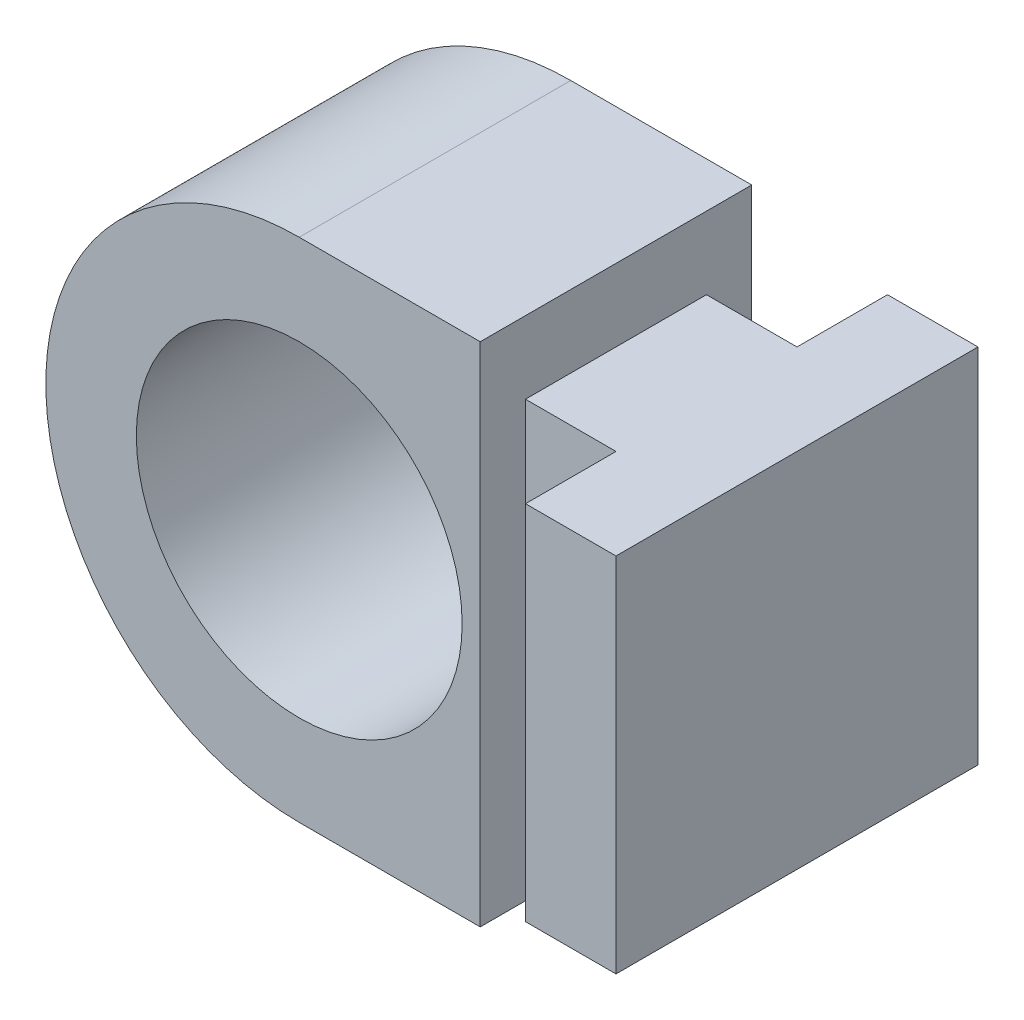
ISO-10303-21;
HEADER;
FILE_DESCRIPTION(('STEP AP214'),'2;1');
FILE_NAME('part.step','',(''),(''),'','','');
FILE_SCHEMA(('AUTOMOTIVE_DESIGN { 1 0 10303 214 1 1 1 1 }'));
ENDSEC;
DATA;
#1=APPLICATION_CONTEXT('core data for automotive mechanical design processes');
#2=APPLICATION_PROTOCOL_DEFINITION('international standard','automotive_design',2000,#1);
#3=PRODUCT_CONTEXT('',#1,'mechanical');
#4=PRODUCT('Part','Part','',(#3));
#5=PRODUCT_RELATED_PRODUCT_CATEGORY('part','',(#4));
#6=PRODUCT_DEFINITION_FORMATION('','',#4);
#7=PRODUCT_DEFINITION_CONTEXT('part definition',#1,'design');
#8=PRODUCT_DEFINITION('design','',#6,#7);
#9=PRODUCT_DEFINITION_SHAPE('','',#8);
#10=(LENGTH_UNIT() NAMED_UNIT(*) SI_UNIT(.MILLI.,.METRE.));
#11=(NAMED_UNIT(*) PLANE_ANGLE_UNIT() SI_UNIT($,.RADIAN.));
#12=(NAMED_UNIT(*) SI_UNIT($,.STERADIAN.) SOLID_ANGLE_UNIT());
#13=UNCERTAINTY_MEASURE_WITH_UNIT(LENGTH_MEASURE(1.E-05),#10,'distance_accuracy_value','');
#14=(GEOMETRIC_REPRESENTATION_CONTEXT(3) GLOBAL_UNCERTAINTY_ASSIGNED_CONTEXT((#13)) GLOBAL_UNIT_ASSIGNED_CONTEXT((#10,
#11,#12)) REPRESENTATION_CONTEXT('',''));
#15=CARTESIAN_POINT('',(0.,0.,0.));
#16=DIRECTION('',(0.,0.,1.));
#17=DIRECTION('',(1.,0.,0.));
#18=AXIS2_PLACEMENT_3D('',#15,#16,#17);
#19=CARTESIAN_POINT('',(10.,-10.,-5.));
#20=DIRECTION('',(-1.,0.,0.));
#21=DIRECTION('',(0.,0.,1.));
#22=AXIS2_PLACEMENT_3D('',#19,#20,#21);
#23=PLANE('',#22);
#24=DIRECTION('',(0.,0.,1.));
#25=VECTOR('',#24,1.);
#26=CARTESIAN_POINT('',(10.,10.,-5.));
#27=LINE('',#26,#25);
#28=CARTESIAN_POINT('',(10.,10.,-5.));
#29=VERTEX_POINT('',#28);
#30=CARTESIAN_POINT('',(10.,10.,5.));
#31=VERTEX_POINT('',#30);
#32=EDGE_CURVE('E143',#29,#31,#27,.T.);
#33=ORIENTED_EDGE('',*,*,#32,.F.);
#34=DIRECTION('',(0.,1.,0.));
#35=VECTOR('',#34,1.);
#36=CARTESIAN_POINT('',(10.,-10.,-5.));
#37=LINE('',#36,#35);
#38=CARTESIAN_POINT('',(10.,-10.,-5.));
#39=VERTEX_POINT('',#38);
#40=EDGE_CURVE('E12',#39,#29,#37,.T.);
#41=ORIENTED_EDGE('',*,*,#40,.F.);
#42=DIRECTION('',(0.,0.,1.));
#43=VECTOR('',#42,1.);
#44=CARTESIAN_POINT('',(10.,-10.,-5.));
#45=LINE('',#44,#43);
#46=CARTESIAN_POINT('',(10.,-10.,5.));
#47=VERTEX_POINT('',#46);
#48=EDGE_CURVE('E163',#39,#47,#45,.T.);
#49=ORIENTED_EDGE('',*,*,#48,.T.);
#50=DIRECTION('',(0.,1.,0.));
#51=VECTOR('',#50,1.);
#52=CARTESIAN_POINT('',(10.,-10.,5.));
#53=LINE('',#52,#51);
#54=EDGE_CURVE('E49',#47,#31,#53,.T.);
#55=ORIENTED_EDGE('',*,*,#54,.T.);
#56=EDGE_LOOP('',(#33,#41,#49,#55));
#57=FACE_BOUND('',#56,.T.);
#58=ADVANCED_FACE('F46',(#57),#23,.T.);
#59=CARTESIAN_POINT('',(10.,-10.,-5.));
#60=DIRECTION('',(0.,0.,-1.));
#61=DIRECTION('',(-1.,0.,0.));
#62=AXIS2_PLACEMENT_3D('',#59,#60,#61);
#63=PLANE('',#62);
#64=DIRECTION('',(-1.,0.,0.));
#65=VECTOR('',#64,1.);
#66=CARTESIAN_POINT('',(10.,10.,-5.));
#67=LINE('',#66,#65);
#68=CARTESIAN_POINT('',(15.,10.,-5.));
#69=VERTEX_POINT('',#68);
#70=EDGE_CURVE('E161',#69,#29,#67,.T.);
#71=ORIENTED_EDGE('',*,*,#70,.F.);
#72=DIRECTION('',(0.,1.,0.));
#73=VECTOR('',#72,1.);
#74=CARTESIAN_POINT('',(15.,-10.,-5.));
#75=LINE('',#74,#73);
#76=CARTESIAN_POINT('',(15.,-10.,-5.));
#77=VERTEX_POINT('',#76);
#78=EDGE_CURVE('E55',#77,#69,#75,.T.);
#79=ORIENTED_EDGE('',*,*,#78,.F.);
#80=DIRECTION('',(-1.,0.,0.));
#81=VECTOR('',#80,1.);
#82=CARTESIAN_POINT('',(10.,-10.,-5.));
#83=LINE('',#82,#81);
#84=EDGE_CURVE('E133',#77,#39,#83,.T.);
#85=ORIENTED_EDGE('',*,*,#84,.T.);
#86=ORIENTED_EDGE('',*,*,#40,.T.);
#87=EDGE_LOOP('',(#71,#79,#85,#86));
#88=FACE_BOUND('',#87,.T.);
#89=ADVANCED_FACE('F175',(#88),#63,.T.);
#90=CARTESIAN_POINT('',(15.,-10.,-5.));
#91=DIRECTION('',(-1.,0.,0.));
#92=DIRECTION('',(0.,0.,1.));
#93=AXIS2_PLACEMENT_3D('',#90,#91,#92);
#94=PLANE('',#93);
#95=DIRECTION('',(0.,0.,1.));
#96=VECTOR('',#95,1.);
#97=CARTESIAN_POINT('',(15.,10.,-5.));
#98=LINE('',#97,#96);
#99=CARTESIAN_POINT('',(15.,10.,-10.));
#100=VERTEX_POINT('',#99);
#101=EDGE_CURVE('E120',#100,#69,#98,.T.);
#102=ORIENTED_EDGE('',*,*,#101,.F.);
#103=DIRECTION('',(0.,1.,0.));
#104=VECTOR('',#103,1.);
#105=CARTESIAN_POINT('',(15.,-10.,-10.));
#106=LINE('',#105,#104);
#107=CARTESIAN_POINT('',(15.,-10.,-10.));
#108=VERTEX_POINT('',#107);
#109=EDGE_CURVE('E115',#108,#100,#106,.T.);
#110=ORIENTED_EDGE('',*,*,#109,.F.);
#111=DIRECTION('',(0.,0.,1.));
#112=VECTOR('',#111,1.);
#113=CARTESIAN_POINT('',(15.,-10.,-5.));
#114=LINE('',#113,#112);
#115=EDGE_CURVE('E118',#108,#77,#114,.T.);
#116=ORIENTED_EDGE('',*,*,#115,.T.);
#117=ORIENTED_EDGE('',*,*,#78,.T.);
#118=EDGE_LOOP('',(#102,#110,#116,#117));
#119=FACE_BOUND('',#118,.T.);
#120=ADVANCED_FACE('F117',(#119),#94,.T.);
#121=CARTESIAN_POINT('',(15.,-10.,-10.));
#122=DIRECTION('',(0.,0.,-1.));
#123=DIRECTION('',(-1.,0.,0.));
#124=AXIS2_PLACEMENT_3D('',#121,#122,#123);
#125=PLANE('',#124);
#126=DIRECTION('',(-1.,0.,0.));
#127=VECTOR('',#126,1.);
#128=CARTESIAN_POINT('',(15.,10.,-10.));
#129=LINE('',#128,#127);
#130=CARTESIAN_POINT('',(20.,10.,-10.));
#131=VERTEX_POINT('',#130);
#132=EDGE_CURVE('E158',#131,#100,#129,.T.);
#133=ORIENTED_EDGE('',*,*,#132,.F.);
#134=DIRECTION('',(0.,1.,0.));
#135=VECTOR('',#134,1.);
#136=CARTESIAN_POINT('',(20.,-10.,-10.));
#137=LINE('',#136,#135);
#138=CARTESIAN_POINT('',(20.,-10.,-10.));
#139=VERTEX_POINT('',#138);
#140=EDGE_CURVE('E125',#139,#131,#137,.T.);
#141=ORIENTED_EDGE('',*,*,#140,.F.);
#142=DIRECTION('',(-1.,0.,0.));
#143=VECTOR('',#142,1.);
#144=CARTESIAN_POINT('',(15.,-10.,-10.));
#145=LINE('',#144,#143);
#146=EDGE_CURVE('E131',#139,#108,#145,.T.);
#147=ORIENTED_EDGE('',*,*,#146,.T.);
#148=ORIENTED_EDGE('',*,*,#109,.T.);
#149=EDGE_LOOP('',(#133,#141,#147,#148));
#150=FACE_BOUND('',#149,.T.);
#151=ADVANCED_FACE('F135',(#150),#125,.T.);
#152=CARTESIAN_POINT('',(20.,-10.,-10.));
#153=DIRECTION('',(1.,0.,0.));
#154=DIRECTION('',(0.,0.,-1.));
#155=AXIS2_PLACEMENT_3D('',#152,#153,#154);
#156=PLANE('',#155);
#157=DIRECTION('',(0.,0.,-1.));
#158=VECTOR('',#157,1.);
#159=CARTESIAN_POINT('',(20.,10.,-10.));
#160=LINE('',#159,#158);
#161=CARTESIAN_POINT('',(20.,10.,10.));
#162=VERTEX_POINT('',#161);
#163=EDGE_CURVE('E155',#162,#131,#160,.T.);
#164=ORIENTED_EDGE('',*,*,#163,.F.);
#165=DIRECTION('',(0.,1.,0.));
#166=VECTOR('',#165,1.);
#167=CARTESIAN_POINT('',(20.,-10.,10.));
#168=LINE('',#167,#166);
#169=CARTESIAN_POINT('',(20.,-10.,10.));
#170=VERTEX_POINT('',#169);
#171=EDGE_CURVE('E167',#170,#162,#168,.T.);
#172=ORIENTED_EDGE('',*,*,#171,.F.);
#173=DIRECTION('',(0.,0.,-1.));
#174=VECTOR('',#173,1.);
#175=CARTESIAN_POINT('',(20.,-10.,-10.));
#176=LINE('',#175,#174);
#177=EDGE_CURVE('E136',#170,#139,#176,.T.);
#178=ORIENTED_EDGE('',*,*,#177,.T.);
#179=ORIENTED_EDGE('',*,*,#140,.T.);
#180=EDGE_LOOP('',(#164,#172,#178,#179));
#181=FACE_BOUND('',#180,.T.);
#182=ADVANCED_FACE('F188',(#181),#156,.T.);
#183=CARTESIAN_POINT('',(15.,-10.,10.));
#184=DIRECTION('',(0.,0.,1.));
#185=DIRECTION('',(1.,0.,0.));
#186=AXIS2_PLACEMENT_3D('',#183,#184,#185);
#187=PLANE('',#186);
#188=DIRECTION('',(1.,0.,0.));
#189=VECTOR('',#188,1.);
#190=CARTESIAN_POINT('',(15.,10.,10.));
#191=LINE('',#190,#189);
#192=CARTESIAN_POINT('',(15.,10.,10.));
#193=VERTEX_POINT('',#192);
#194=EDGE_CURVE('E152',#193,#162,#191,.T.);
#195=ORIENTED_EDGE('',*,*,#194,.F.);
#196=DIRECTION('',(0.,1.,0.));
#197=VECTOR('',#196,1.);
#198=CARTESIAN_POINT('',(15.,-10.,10.));
#199=LINE('',#198,#197);
#200=CARTESIAN_POINT('',(15.,-10.,10.));
#201=VERTEX_POINT('',#200);
#202=EDGE_CURVE('E169',#201,#193,#199,.T.);
#203=ORIENTED_EDGE('',*,*,#202,.F.);
#204=DIRECTION('',(1.,0.,0.));
#205=VECTOR('',#204,1.);
#206=CARTESIAN_POINT('',(15.,-10.,10.));
#207=LINE('',#206,#205);
#208=EDGE_CURVE('E138',#201,#170,#207,.T.);
#209=ORIENTED_EDGE('',*,*,#208,.T.);
#210=ORIENTED_EDGE('',*,*,#171,.T.);
#211=EDGE_LOOP('',(#195,#203,#209,#210));
#212=FACE_BOUND('',#211,.T.);
#213=ADVANCED_FACE('F191',(#212),#187,.T.);
#214=CARTESIAN_POINT('',(15.,-10.,5.));
#215=DIRECTION('',(-1.,0.,0.));
#216=DIRECTION('',(0.,0.,1.));
#217=AXIS2_PLACEMENT_3D('',#214,#215,#216);
#218=PLANE('',#217);
#219=DIRECTION('',(0.,0.,1.));
#220=VECTOR('',#219,1.);
#221=CARTESIAN_POINT('',(15.,10.,5.));
#222=LINE('',#221,#220);
#223=CARTESIAN_POINT('',(15.,10.,5.));
#224=VERTEX_POINT('',#223);
#225=EDGE_CURVE('E149',#224,#193,#222,.T.);
#226=ORIENTED_EDGE('',*,*,#225,.F.);
#227=DIRECTION('',(0.,1.,0.));
#228=VECTOR('',#227,1.);
#229=CARTESIAN_POINT('',(15.,-10.,5.));
#230=LINE('',#229,#228);
#231=CARTESIAN_POINT('',(15.,-10.,5.));
#232=VERTEX_POINT('',#231);
#233=EDGE_CURVE('E170',#232,#224,#230,.T.);
#234=ORIENTED_EDGE('',*,*,#233,.F.);
#235=DIRECTION('',(0.,0.,1.));
#236=VECTOR('',#235,1.);
#237=CARTESIAN_POINT('',(15.,-10.,5.));
#238=LINE('',#237,#236);
#239=EDGE_CURVE('E286',#232,#201,#238,.T.);
#240=ORIENTED_EDGE('',*,*,#239,.T.);
#241=ORIENTED_EDGE('',*,*,#202,.T.);
#242=EDGE_LOOP('',(#226,#234,#240,#241));
#243=FACE_BOUND('',#242,.T.);
#244=ADVANCED_FACE('F195',(#243),#218,.T.);
#245=CARTESIAN_POINT('',(10.,-10.,5.));
#246=DIRECTION('',(0.,0.,1.));
#247=DIRECTION('',(1.,0.,0.));
#248=AXIS2_PLACEMENT_3D('',#245,#246,#247);
#249=PLANE('',#248);
#250=DIRECTION('',(1.,0.,0.));
#251=VECTOR('',#250,1.);
#252=CARTESIAN_POINT('',(10.,10.,5.));
#253=LINE('',#252,#251);
#254=EDGE_CURVE('E146',#31,#224,#253,.T.);
#255=ORIENTED_EDGE('',*,*,#254,.F.);
#256=ORIENTED_EDGE('',*,*,#54,.F.);
#257=DIRECTION('',(1.,0.,0.));
#258=VECTOR('',#257,1.);
#259=CARTESIAN_POINT('',(10.,-10.,5.));
#260=LINE('',#259,#258);
#261=EDGE_CURVE('E287',#47,#232,#260,.T.);
#262=ORIENTED_EDGE('',*,*,#261,.T.);
#263=ORIENTED_EDGE('',*,*,#233,.T.);
#264=EDGE_LOOP('',(#255,#256,#262,#263));
#265=FACE_BOUND('',#264,.T.);
#266=ADVANCED_FACE('F172',(#265),#249,.T.);
#267=CARTESIAN_POINT('',(0.,-10.,0.));
#268=DIRECTION('',(0.,1.,0.));
#269=DIRECTION('',(0.,0.,1.));
#270=AXIS2_PLACEMENT_3D('',#267,#268,#269);
#271=PLANE('',#270);
#272=ORIENTED_EDGE('',*,*,#48,.F.);
#273=ORIENTED_EDGE('',*,*,#84,.F.);
#274=ORIENTED_EDGE('',*,*,#115,.F.);
#275=ORIENTED_EDGE('',*,*,#146,.F.);
#276=ORIENTED_EDGE('',*,*,#177,.F.);
#277=ORIENTED_EDGE('',*,*,#208,.F.);
#278=ORIENTED_EDGE('',*,*,#239,.F.);
#279=ORIENTED_EDGE('',*,*,#261,.F.);
#280=EDGE_LOOP('',(#272,#273,#274,#275,#276,#277,#278,#279));
#281=FACE_BOUND('',#280,.T.);
#282=ADVANCED_FACE('F129',(#281),#271,.F.);
#283=CARTESIAN_POINT('',(0.,10.,0.));
#284=DIRECTION('',(0.,1.,0.));
#285=DIRECTION('',(0.,0.,1.));
#286=AXIS2_PLACEMENT_3D('',#283,#284,#285);
#287=PLANE('',#286);
#288=ORIENTED_EDGE('',*,*,#32,.T.);
#289=ORIENTED_EDGE('',*,*,#254,.T.);
#290=ORIENTED_EDGE('',*,*,#225,.T.);
#291=ORIENTED_EDGE('',*,*,#194,.T.);
#292=ORIENTED_EDGE('',*,*,#163,.T.);
#293=ORIENTED_EDGE('',*,*,#132,.T.);
#294=ORIENTED_EDGE('',*,*,#101,.T.);
#295=ORIENTED_EDGE('',*,*,#70,.T.);
#296=EDGE_LOOP('',(#288,#289,#290,#291,#292,#293,#294,#295));
#297=FACE_BOUND('',#296,.T.);
#298=ADVANCED_FACE('F174',(#297),#287,.T.);
#299=CLOSED_SHELL('',(#58,#89,#120,#151,#182,#213,#244,#266,#282,#298));
#300=MANIFOLD_SOLID_BREP('B2',#299);
#301=CARTESIAN_POINT('',(0.,0.,7.5));
#302=DIRECTION('',(0.,0.,1.));
#303=DIRECTION('',(1.,0.,0.));
#304=AXIS2_PLACEMENT_3D('',#301,#302,#303);
#305=PLANE('',#304);
#306=CARTESIAN_POINT('',(0.,0.,7.5));
#307=DIRECTION('',(0.,0.,1.));
#308=DIRECTION('',(1.,0.,0.));
#309=AXIS2_PLACEMENT_3D('',#306,#307,#308);
#310=CIRCLE('',#309,14.);
#311=CARTESIAN_POINT('',(0.,14.,7.5));
#312=VERTEX_POINT('',#311);
#313=CARTESIAN_POINT('',(0.,-14.,7.5));
#314=VERTEX_POINT('',#313);
#315=EDGE_CURVE('E345',#312,#314,#310,.T.);
#316=ORIENTED_EDGE('',*,*,#315,.T.);
#317=DIRECTION('',(1.,0.,0.));
#318=VECTOR('',#317,1.);
#319=CARTESIAN_POINT('',(0.,-14.,7.5));
#320=LINE('',#319,#318);
#321=CARTESIAN_POINT('',(10.,-14.,7.5));
#322=VERTEX_POINT('',#321);
#323=EDGE_CURVE('E340',#314,#322,#320,.T.);
#324=ORIENTED_EDGE('',*,*,#323,.T.);
#325=DIRECTION('',(0.,1.,0.));
#326=VECTOR('',#325,1.);
#327=CARTESIAN_POINT('',(10.,14.,7.5));
#328=LINE('',#327,#326);
#329=CARTESIAN_POINT('',(10.,14.,7.5));
#330=VERTEX_POINT('',#329);
#331=EDGE_CURVE('E343',#322,#330,#328,.T.);
#332=ORIENTED_EDGE('',*,*,#331,.T.);
#333=DIRECTION('',(-1.,0.,0.));
#334=VECTOR('',#333,1.);
#335=CARTESIAN_POINT('',(0.,14.,7.5));
#336=LINE('',#335,#334);
#337=EDGE_CURVE('E310',#330,#312,#336,.T.);
#338=ORIENTED_EDGE('',*,*,#337,.T.);
#339=EDGE_LOOP('',(#316,#324,#332,#338));
#340=FACE_BOUND('',#339,.T.);
#341=CARTESIAN_POINT('',(0.,0.,7.5));
#342=DIRECTION('',(0.,0.,1.));
#343=DIRECTION('',(1.,0.,0.));
#344=AXIS2_PLACEMENT_3D('',#341,#342,#343);
#345=CIRCLE('',#344,9.);
#346=CARTESIAN_POINT('',(9.,0.,7.5));
#347=VERTEX_POINT('',#346);
#348=EDGE_CURVE('E360',#347,#347,#345,.T.);
#349=ORIENTED_EDGE('',*,*,#348,.F.);
#350=EDGE_LOOP('',(#349));
#351=FACE_BOUND('',#350,.T.);
#352=ADVANCED_FACE('F293',(#340,#351),#305,.T.);
#353=CARTESIAN_POINT('',(0.,0.,-7.5));
#354=DIRECTION('',(0.,0.,1.));
#355=DIRECTION('',(1.,0.,0.));
#356=AXIS2_PLACEMENT_3D('',#353,#354,#355);
#357=PLANE('',#356);
#358=CARTESIAN_POINT('',(0.,0.,-7.5));
#359=DIRECTION('',(0.,0.,1.));
#360=DIRECTION('',(1.,0.,0.));
#361=AXIS2_PLACEMENT_3D('',#358,#359,#360);
#362=CIRCLE('',#361,14.);
#363=CARTESIAN_POINT('',(0.,14.,-7.5));
#364=VERTEX_POINT('',#363);
#365=CARTESIAN_POINT('',(0.,-14.,-7.5));
#366=VERTEX_POINT('',#365);
#367=EDGE_CURVE('E357',#364,#366,#362,.T.);
#368=ORIENTED_EDGE('',*,*,#367,.F.);
#369=DIRECTION('',(-1.,0.,0.));
#370=VECTOR('',#369,1.);
#371=CARTESIAN_POINT('',(0.,14.,-7.5));
#372=LINE('',#371,#370);
#373=CARTESIAN_POINT('',(10.,14.,-7.5));
#374=VERTEX_POINT('',#373);
#375=EDGE_CURVE('E333',#374,#364,#372,.T.);
#376=ORIENTED_EDGE('',*,*,#375,.F.);
#377=DIRECTION('',(0.,1.,0.));
#378=VECTOR('',#377,1.);
#379=CARTESIAN_POINT('',(10.,14.,-7.5));
#380=LINE('',#379,#378);
#381=CARTESIAN_POINT('',(10.,-14.,-7.5));
#382=VERTEX_POINT('',#381);
#383=EDGE_CURVE('E327',#382,#374,#380,.T.);
#384=ORIENTED_EDGE('',*,*,#383,.F.);
#385=DIRECTION('',(1.,0.,0.));
#386=VECTOR('',#385,1.);
#387=CARTESIAN_POINT('',(0.,-14.,-7.5));
#388=LINE('',#387,#386);
#389=EDGE_CURVE('E349',#366,#382,#388,.T.);
#390=ORIENTED_EDGE('',*,*,#389,.F.);
#391=EDGE_LOOP('',(#368,#376,#384,#390));
#392=FACE_BOUND('',#391,.T.);
#393=CARTESIAN_POINT('',(0.,0.,-7.5));
#394=DIRECTION('',(0.,0.,1.));
#395=DIRECTION('',(1.,0.,0.));
#396=AXIS2_PLACEMENT_3D('',#393,#394,#395);
#397=CIRCLE('',#396,9.);
#398=CARTESIAN_POINT('',(9.,0.,-7.5));
#399=VERTEX_POINT('',#398);
#400=EDGE_CURVE('E372',#399,#399,#397,.T.);
#401=ORIENTED_EDGE('',*,*,#400,.T.);
#402=EDGE_LOOP('',(#401));
#403=FACE_BOUND('',#402,.T.);
#404=ADVANCED_FACE('F368',(#392,#403),#357,.F.);
#405=CARTESIAN_POINT('',(0.,0.,7.5));
#406=DIRECTION('',(0.,0.,-1.));
#407=DIRECTION('',(-1.,0.,0.));
#408=AXIS2_PLACEMENT_3D('',#405,#406,#407);
#409=CYLINDRICAL_SURFACE('',#408,14.);
#410=ORIENTED_EDGE('',*,*,#367,.T.);
#411=DIRECTION('',(0.,0.,-1.));
#412=VECTOR('',#411,1.);
#413=CARTESIAN_POINT('',(0.,-14.,7.5));
#414=LINE('',#413,#412);
#415=EDGE_CURVE('E44',#314,#366,#414,.T.);
#416=ORIENTED_EDGE('',*,*,#415,.F.);
#417=ORIENTED_EDGE('',*,*,#315,.F.);
#418=DIRECTION('',(0.,0.,-1.));
#419=VECTOR('',#418,1.);
#420=CARTESIAN_POINT('',(0.,14.,7.5));
#421=LINE('',#420,#419);
#422=EDGE_CURVE('E353',#312,#364,#421,.T.);
#423=ORIENTED_EDGE('',*,*,#422,.T.);
#424=EDGE_LOOP('',(#410,#416,#417,#423));
#425=FACE_BOUND('',#424,.T.);
#426=ADVANCED_FACE('F295',(#425),#409,.T.);
#427=CARTESIAN_POINT('',(0.,-14.,7.5));
#428=DIRECTION('',(0.,1.,0.));
#429=DIRECTION('',(0.,0.,1.));
#430=AXIS2_PLACEMENT_3D('',#427,#428,#429);
#431=PLANE('',#430);
#432=ORIENTED_EDGE('',*,*,#389,.T.);
#433=DIRECTION('',(0.,0.,-1.));
#434=VECTOR('',#433,1.);
#435=CARTESIAN_POINT('',(10.,-14.,7.5));
#436=LINE('',#435,#434);
#437=EDGE_CURVE('E302',#322,#382,#436,.T.);
#438=ORIENTED_EDGE('',*,*,#437,.F.);
#439=ORIENTED_EDGE('',*,*,#323,.F.);
#440=ORIENTED_EDGE('',*,*,#415,.T.);
#441=EDGE_LOOP('',(#432,#438,#439,#440));
#442=FACE_BOUND('',#441,.T.);
#443=ADVANCED_FACE('F348',(#442),#431,.F.);
#444=CARTESIAN_POINT('',(10.,14.,7.5));
#445=DIRECTION('',(-1.,0.,0.));
#446=DIRECTION('',(0.,0.,1.));
#447=AXIS2_PLACEMENT_3D('',#444,#445,#446);
#448=PLANE('',#447);
#449=ORIENTED_EDGE('',*,*,#383,.T.);
#450=DIRECTION('',(0.,0.,-1.));
#451=VECTOR('',#450,1.);
#452=CARTESIAN_POINT('',(10.,14.,7.5));
#453=LINE('',#452,#451);
#454=EDGE_CURVE('E350',#330,#374,#453,.T.);
#455=ORIENTED_EDGE('',*,*,#454,.F.);
#456=ORIENTED_EDGE('',*,*,#331,.F.);
#457=ORIENTED_EDGE('',*,*,#437,.T.);
#458=EDGE_LOOP('',(#449,#455,#456,#457));
#459=FACE_BOUND('',#458,.T.);
#460=ADVANCED_FACE('F351',(#459),#448,.F.);
#461=CARTESIAN_POINT('',(0.,14.,7.5));
#462=DIRECTION('',(0.,-1.,0.));
#463=DIRECTION('',(0.,0.,-1.));
#464=AXIS2_PLACEMENT_3D('',#461,#462,#463);
#465=PLANE('',#464);
#466=ORIENTED_EDGE('',*,*,#375,.T.);
#467=ORIENTED_EDGE('',*,*,#422,.F.);
#468=ORIENTED_EDGE('',*,*,#337,.F.);
#469=ORIENTED_EDGE('',*,*,#454,.T.);
#470=EDGE_LOOP('',(#466,#467,#468,#469));
#471=FACE_BOUND('',#470,.T.);
#472=ADVANCED_FACE('F365',(#471),#465,.F.);
#473=CARTESIAN_POINT('',(0.,0.,7.5));
#474=DIRECTION('',(0.,0.,-1.));
#475=DIRECTION('',(-1.,0.,0.));
#476=AXIS2_PLACEMENT_3D('',#473,#474,#475);
#477=CYLINDRICAL_SURFACE('',#476,9.);
#478=ORIENTED_EDGE('',*,*,#348,.T.);
#479=EDGE_LOOP('',(#478));
#480=FACE_BOUND('',#479,.T.);
#481=ORIENTED_EDGE('',*,*,#400,.F.);
#482=EDGE_LOOP('',(#481));
#483=FACE_BOUND('',#482,.T.);
#484=ADVANCED_FACE('F378',(#480,#483),#477,.F.);
#485=CLOSED_SHELL('',(#352,#404,#426,#443,#460,#472,#484));
#486=MANIFOLD_SOLID_BREP('B6',#485);
#487=ADVANCED_BREP_SHAPE_REPRESENTATION('',(#18,#300,#486),#14);
#488=SHAPE_DEFINITION_REPRESENTATION(#9,#487);
ENDSEC;
END-ISO-10303-21;
